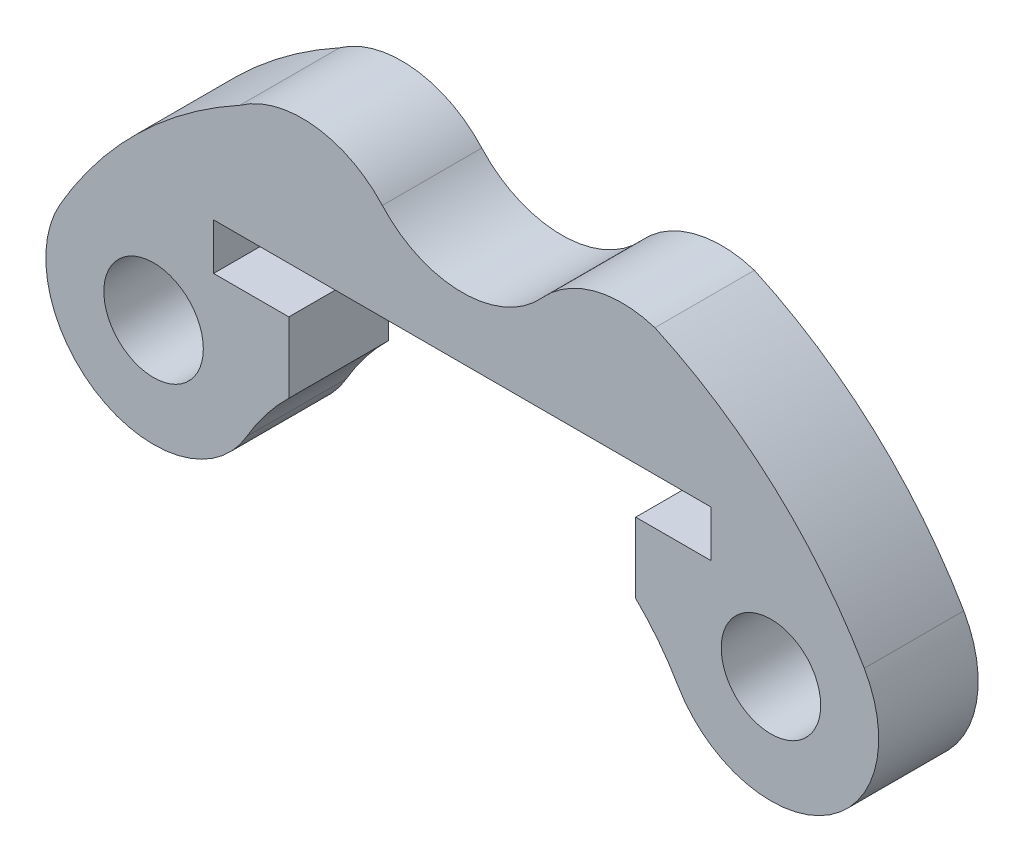
ISO-10303-21;
HEADER;
FILE_DESCRIPTION(('STEP AP214'),'2;1');
FILE_NAME('part.step','',(''),(''),'','','');
FILE_SCHEMA(('AUTOMOTIVE_DESIGN { 1 0 10303 214 1 1 1 1 }'));
ENDSEC;
DATA;
#1=APPLICATION_CONTEXT('core data for automotive mechanical design processes');
#2=APPLICATION_PROTOCOL_DEFINITION('international standard','automotive_design',2000,#1);
#3=PRODUCT_CONTEXT('',#1,'mechanical');
#4=PRODUCT('Part','Part','',(#3));
#5=PRODUCT_RELATED_PRODUCT_CATEGORY('part','',(#4));
#6=PRODUCT_DEFINITION_FORMATION('','',#4);
#7=PRODUCT_DEFINITION_CONTEXT('part definition',#1,'design');
#8=PRODUCT_DEFINITION('design','',#6,#7);
#9=PRODUCT_DEFINITION_SHAPE('','',#8);
#10=(LENGTH_UNIT() NAMED_UNIT(*) SI_UNIT(.MILLI.,.METRE.));
#11=(NAMED_UNIT(*) PLANE_ANGLE_UNIT() SI_UNIT($,.RADIAN.));
#12=(NAMED_UNIT(*) SI_UNIT($,.STERADIAN.) SOLID_ANGLE_UNIT());
#13=UNCERTAINTY_MEASURE_WITH_UNIT(LENGTH_MEASURE(1.E-05),#10,'distance_accuracy_value','');
#14=(GEOMETRIC_REPRESENTATION_CONTEXT(3) GLOBAL_UNCERTAINTY_ASSIGNED_CONTEXT((#13)) GLOBAL_UNIT_ASSIGNED_CONTEXT((#10,
#11,#12)) REPRESENTATION_CONTEXT('',''));
#15=CARTESIAN_POINT('',(0.,0.,0.));
#16=DIRECTION('',(0.,0.,1.));
#17=DIRECTION('',(1.,0.,0.));
#18=AXIS2_PLACEMENT_3D('',#15,#16,#17);
#19=CARTESIAN_POINT('',(0.,0.,3.));
#20=DIRECTION('',(0.,0.,1.));
#21=DIRECTION('',(1.,0.,0.));
#22=AXIS2_PLACEMENT_3D('',#19,#20,#21);
#23=PLANE('',#22);
#24=CARTESIAN_POINT('',(9.30977309068468,5.3749999999966,3.));
#25=DIRECTION('',(0.,0.,1.));
#26=DIRECTION('',(1.,0.,0.));
#27=AXIS2_PLACEMENT_3D('',#24,#25,#26);
#28=CIRCLE('',#27,1.49999999999907);
#29=CARTESIAN_POINT('',(10.8097730906838,5.3749999999966,3.));
#30=VERTEX_POINT('',#29);
#31=EDGE_CURVE('E181',#30,#30,#28,.T.);
#32=ORIENTED_EDGE('',*,*,#31,.F.);
#33=EDGE_LOOP('',(#32));
#34=FACE_BOUND('',#33,.T.);
#35=DIRECTION('',(0.,-1.,0.));
#36=VECTOR('',#35,1.);
#37=CARTESIAN_POINT('',(7.5000000000001,8.9,3.));
#38=LINE('',#37,#36);
#39=CARTESIAN_POINT('',(7.5000000000001,8.9,3.));
#40=VERTEX_POINT('',#39);
#41=CARTESIAN_POINT('',(7.5,7.5,3.));
#42=VERTEX_POINT('',#41);
#43=EDGE_CURVE('E208',#40,#42,#38,.T.);
#44=ORIENTED_EDGE('',*,*,#43,.T.);
#45=DIRECTION('',(-1.,0.,0.));
#46=VECTOR('',#45,1.);
#47=CARTESIAN_POINT('',(5.23061898822938,7.5,3.));
#48=LINE('',#47,#46);
#49=CARTESIAN_POINT('',(5.23061898822938,7.5,3.));
#50=VERTEX_POINT('',#49);
#51=EDGE_CURVE('E116',#42,#50,#48,.T.);
#52=ORIENTED_EDGE('',*,*,#51,.T.);
#53=DIRECTION('',(1.351043460112E-13,-1.,0.));
#54=VECTOR('',#53,1.);
#55=CARTESIAN_POINT('',(5.23061898822966,5.37499999999733,3.));
#56=LINE('',#55,#54);
#57=CARTESIAN_POINT('',(5.23061898822966,5.37499999999733,3.));
#58=VERTEX_POINT('',#57);
#59=EDGE_CURVE('E247',#50,#58,#56,.T.);
#60=ORIENTED_EDGE('',*,*,#59,.T.);
#61=CARTESIAN_POINT('',(0.,0.,3.));
#62=DIRECTION('',(0.,0.,-1.));
#63=DIRECTION('',(1.,0.,0.));
#64=AXIS2_PLACEMENT_3D('',#61,#62,#63);
#65=CIRCLE('',#64,7.5);
#66=CARTESIAN_POINT('',(6.49519052838322,3.75000000000011,3.));
#67=VERTEX_POINT('',#66);
#68=EDGE_CURVE('E266',#58,#67,#65,.T.);
#69=ORIENTED_EDGE('',*,*,#68,.T.);
#70=CARTESIAN_POINT('',(9.30977309068468,5.3749999999966,3.));
#71=DIRECTION('',(0.,0.,1.));
#72=DIRECTION('',(1.,0.,0.));
#73=AXIS2_PLACEMENT_3D('',#70,#71,#72);
#74=CIRCLE('',#73,3.25);
#75=CARTESIAN_POINT('',(12.1243556529847,6.99999999999558,3.));
#76=VERTEX_POINT('',#75);
#77=EDGE_CURVE('E263',#67,#76,#74,.T.);
#78=ORIENTED_EDGE('',*,*,#77,.T.);
#79=CARTESIAN_POINT('',(0.,0.,3.));
#80=DIRECTION('',(0.,0.,1.));
#81=DIRECTION('',(1.,0.,0.));
#82=AXIS2_PLACEMENT_3D('',#79,#80,#81);
#83=CIRCLE('',#82,14.);
#84=CARTESIAN_POINT('',(5.80943087987062,12.7377593340432,3.));
#85=VERTEX_POINT('',#84);
#86=EDGE_CURVE('E265',#76,#85,#83,.T.);
#87=ORIENTED_EDGE('',*,*,#86,.T.);
#88=CARTESIAN_POINT('',(4.82206978136234,9.64137142857136,3.));
#89=DIRECTION('',(0.,0.,1.));
#90=DIRECTION('',(1.,0.,0.));
#91=AXIS2_PLACEMENT_3D('',#88,#89,#90);
#92=CIRCLE('',#91,3.25);
#93=CARTESIAN_POINT('',(2.4110348906791,11.8206857142833,3.));
#94=VERTEX_POINT('',#93);
#95=EDGE_CURVE('E268',#85,#94,#92,.T.);
#96=ORIENTED_EDGE('',*,*,#95,.T.);
#97=CARTESIAN_POINT('',(1.07437023516552E-11,13.9999999999817,3.));
#98=DIRECTION('',(0.,0.,-1.));
#99=DIRECTION('',(1.,0.,0.));
#100=AXIS2_PLACEMENT_3D('',#97,#98,#99);
#101=CIRCLE('',#100,3.24999999997992);
#102=CARTESIAN_POINT('',(-2.41103489066095,11.820685714287,3.));
#103=VERTEX_POINT('',#102);
#104=EDGE_CURVE('E274',#94,#103,#101,.T.);
#105=ORIENTED_EDGE('',*,*,#104,.T.);
#106=CARTESIAN_POINT('',(-4.82206978134755,9.64137142857876,3.));
#107=DIRECTION('',(0.,0.,1.));
#108=DIRECTION('',(1.,0.,0.));
#109=AXIS2_PLACEMENT_3D('',#106,#107,#108);
#110=CIRCLE('',#109,3.25);
#111=CARTESIAN_POINT('',(-6.70737151186402,12.2886601141799,3.));
#112=VERTEX_POINT('',#111);
#113=EDGE_CURVE('E276',#103,#112,#110,.T.);
#114=ORIENTED_EDGE('',*,*,#113,.T.);
#115=CARTESIAN_POINT('',(0.,0.,3.));
#116=DIRECTION('',(0.,0.,1.));
#117=DIRECTION('',(1.,0.,0.));
#118=AXIS2_PLACEMENT_3D('',#115,#116,#117);
#119=CIRCLE('',#118,14.);
#120=CARTESIAN_POINT('',(-12.1243556529822,6.99999999999988,3.));
#121=VERTEX_POINT('',#120);
#122=EDGE_CURVE('E278',#112,#121,#119,.T.);
#123=ORIENTED_EDGE('',*,*,#122,.T.);
#124=CARTESIAN_POINT('',(-9.30977309068277,5.37499999999991,3.));
#125=DIRECTION('',(0.,0.,1.));
#126=DIRECTION('',(1.,0.,0.));
#127=AXIS2_PLACEMENT_3D('',#124,#125,#126);
#128=CIRCLE('',#127,3.25);
#129=CARTESIAN_POINT('',(-6.49519052838333,3.74999999999993,3.));
#130=VERTEX_POINT('',#129);
#131=EDGE_CURVE('E280',#121,#130,#128,.T.);
#132=ORIENTED_EDGE('',*,*,#131,.T.);
#133=CARTESIAN_POINT('',(0.,0.,3.));
#134=DIRECTION('',(0.,0.,-1.));
#135=DIRECTION('',(1.,0.,0.));
#136=AXIS2_PLACEMENT_3D('',#133,#134,#135);
#137=CIRCLE('',#136,7.5);
#138=CARTESIAN_POINT('',(-5.23061898822776,5.37499999999918,3.));
#139=VERTEX_POINT('',#138);
#140=EDGE_CURVE('E282',#130,#139,#137,.T.);
#141=ORIENTED_EDGE('',*,*,#140,.T.);
#142=DIRECTION('',(0.,1.,0.));
#143=VECTOR('',#142,1.);
#144=CARTESIAN_POINT('',(-5.23061898822776,5.37499999999918,3.));
#145=LINE('',#144,#143);
#146=CARTESIAN_POINT('',(-5.2306189882276,7.5,3.));
#147=VERTEX_POINT('',#146);
#148=EDGE_CURVE('E159',#139,#147,#145,.T.);
#149=ORIENTED_EDGE('',*,*,#148,.T.);
#150=DIRECTION('',(-1.,0.,0.));
#151=VECTOR('',#150,1.);
#152=CARTESIAN_POINT('',(-5.2306189882276,7.5,3.));
#153=LINE('',#152,#151);
#154=CARTESIAN_POINT('',(-7.5,7.5,3.));
#155=VERTEX_POINT('',#154);
#156=EDGE_CURVE('E153',#147,#155,#153,.T.);
#157=ORIENTED_EDGE('',*,*,#156,.T.);
#158=DIRECTION('',(0.,1.,0.));
#159=VECTOR('',#158,1.);
#160=CARTESIAN_POINT('',(-7.5,7.5,3.));
#161=LINE('',#160,#159);
#162=CARTESIAN_POINT('',(-7.4999999999999,8.9,3.));
#163=VERTEX_POINT('',#162);
#164=EDGE_CURVE('E157',#155,#163,#161,.T.);
#165=ORIENTED_EDGE('',*,*,#164,.T.);
#166=DIRECTION('',(1.,0.,0.));
#167=VECTOR('',#166,1.);
#168=CARTESIAN_POINT('',(7.5000000000001,8.9,3.));
#169=LINE('',#168,#167);
#170=EDGE_CURVE('E49',#163,#40,#169,.T.);
#171=ORIENTED_EDGE('',*,*,#170,.T.);
#172=EDGE_LOOP('',(#44,#52,#60,#69,#78,#87,#96,#105,#114,#123,#132,#141,#149,#157,#165,#171));
#173=FACE_BOUND('',#172,.T.);
#174=CARTESIAN_POINT('',(-9.30977309068277,5.37499999999991,3.));
#175=DIRECTION('',(0.,0.,1.));
#176=DIRECTION('',(1.,0.,0.));
#177=AXIS2_PLACEMENT_3D('',#174,#175,#176);
#178=CIRCLE('',#177,1.5);
#179=CARTESIAN_POINT('',(-7.80977309068277,5.37499999999991,3.));
#180=VERTEX_POINT('',#179);
#181=EDGE_CURVE('E324',#180,#180,#178,.T.);
#182=ORIENTED_EDGE('',*,*,#181,.F.);
#183=EDGE_LOOP('',(#182));
#184=FACE_BOUND('',#183,.T.);
#185=ADVANCED_FACE('F32',(#34,#173,#184),#23,.T.);
#186=CARTESIAN_POINT('',(0.,0.,0.));
#187=DIRECTION('',(0.,0.,1.));
#188=DIRECTION('',(1.,0.,0.));
#189=AXIS2_PLACEMENT_3D('',#186,#187,#188);
#190=PLANE('',#189);
#191=DIRECTION('',(0.,-1.,0.));
#192=VECTOR('',#191,1.);
#193=CARTESIAN_POINT('',(7.5000000000001,8.9,0.));
#194=LINE('',#193,#192);
#195=CARTESIAN_POINT('',(7.5000000000001,8.9,0.));
#196=VERTEX_POINT('',#195);
#197=CARTESIAN_POINT('',(7.5,7.5,0.));
#198=VERTEX_POINT('',#197);
#199=EDGE_CURVE('E177',#196,#198,#194,.T.);
#200=ORIENTED_EDGE('',*,*,#199,.F.);
#201=DIRECTION('',(1.,0.,0.));
#202=VECTOR('',#201,1.);
#203=CARTESIAN_POINT('',(7.5000000000001,8.9,0.));
#204=LINE('',#203,#202);
#205=CARTESIAN_POINT('',(-7.4999999999999,8.9,0.));
#206=VERTEX_POINT('',#205);
#207=EDGE_CURVE('E108',#206,#196,#204,.T.);
#208=ORIENTED_EDGE('',*,*,#207,.F.);
#209=DIRECTION('',(0.,1.,0.));
#210=VECTOR('',#209,1.);
#211=CARTESIAN_POINT('',(-7.5,7.5,0.));
#212=LINE('',#211,#210);
#213=CARTESIAN_POINT('',(-7.5,7.5,0.));
#214=VERTEX_POINT('',#213);
#215=EDGE_CURVE('E102',#214,#206,#212,.T.);
#216=ORIENTED_EDGE('',*,*,#215,.F.);
#217=DIRECTION('',(-1.,0.,0.));
#218=VECTOR('',#217,1.);
#219=CARTESIAN_POINT('',(-5.2306189882276,7.5,0.));
#220=LINE('',#219,#218);
#221=CARTESIAN_POINT('',(-5.2306189882276,7.5,0.));
#222=VERTEX_POINT('',#221);
#223=EDGE_CURVE('E167',#222,#214,#220,.T.);
#224=ORIENTED_EDGE('',*,*,#223,.F.);
#225=DIRECTION('',(0.,1.,0.));
#226=VECTOR('',#225,1.);
#227=CARTESIAN_POINT('',(-5.23061898822776,5.37499999999918,0.));
#228=LINE('',#227,#226);
#229=CARTESIAN_POINT('',(-5.23061898822776,5.37499999999918,0.));
#230=VERTEX_POINT('',#229);
#231=EDGE_CURVE('E203',#230,#222,#228,.T.);
#232=ORIENTED_EDGE('',*,*,#231,.F.);
#233=CARTESIAN_POINT('',(0.,0.,0.));
#234=DIRECTION('',(0.,0.,-1.));
#235=DIRECTION('',(1.,0.,0.));
#236=AXIS2_PLACEMENT_3D('',#233,#234,#235);
#237=CIRCLE('',#236,7.5);
#238=CARTESIAN_POINT('',(-6.49519052838333,3.74999999999993,0.));
#239=VERTEX_POINT('',#238);
#240=EDGE_CURVE('E201',#239,#230,#237,.T.);
#241=ORIENTED_EDGE('',*,*,#240,.F.);
#242=CARTESIAN_POINT('',(-9.30977309068277,5.37499999999991,0.));
#243=DIRECTION('',(0.,0.,1.));
#244=DIRECTION('',(1.,0.,0.));
#245=AXIS2_PLACEMENT_3D('',#242,#243,#244);
#246=CIRCLE('',#245,3.25);
#247=CARTESIAN_POINT('',(-12.1243556529822,6.99999999999988,0.));
#248=VERTEX_POINT('',#247);
#249=EDGE_CURVE('E199',#248,#239,#246,.T.);
#250=ORIENTED_EDGE('',*,*,#249,.F.);
#251=CARTESIAN_POINT('',(0.,0.,0.));
#252=DIRECTION('',(0.,0.,1.));
#253=DIRECTION('',(1.,0.,0.));
#254=AXIS2_PLACEMENT_3D('',#251,#252,#253);
#255=CIRCLE('',#254,14.);
#256=CARTESIAN_POINT('',(-6.70737151186402,12.2886601141799,0.));
#257=VERTEX_POINT('',#256);
#258=EDGE_CURVE('E197',#257,#248,#255,.T.);
#259=ORIENTED_EDGE('',*,*,#258,.F.);
#260=CARTESIAN_POINT('',(-4.82206978134755,9.64137142857876,0.));
#261=DIRECTION('',(0.,0.,1.));
#262=DIRECTION('',(1.,0.,0.));
#263=AXIS2_PLACEMENT_3D('',#260,#261,#262);
#264=CIRCLE('',#263,3.25);
#265=CARTESIAN_POINT('',(-2.41103489066095,11.820685714287,0.));
#266=VERTEX_POINT('',#265);
#267=EDGE_CURVE('E195',#266,#257,#264,.T.);
#268=ORIENTED_EDGE('',*,*,#267,.F.);
#269=CARTESIAN_POINT('',(1.07437023516552E-11,13.9999999999817,0.));
#270=DIRECTION('',(0.,0.,-1.));
#271=DIRECTION('',(1.,0.,0.));
#272=AXIS2_PLACEMENT_3D('',#269,#270,#271);
#273=CIRCLE('',#272,3.24999999997992);
#274=CARTESIAN_POINT('',(2.4110348906791,11.8206857142833,0.));
#275=VERTEX_POINT('',#274);
#276=EDGE_CURVE('E193',#275,#266,#273,.T.);
#277=ORIENTED_EDGE('',*,*,#276,.F.);
#278=CARTESIAN_POINT('',(4.82206978136234,9.64137142857136,0.));
#279=DIRECTION('',(0.,0.,1.));
#280=DIRECTION('',(1.,0.,0.));
#281=AXIS2_PLACEMENT_3D('',#278,#279,#280);
#282=CIRCLE('',#281,3.25);
#283=CARTESIAN_POINT('',(5.80943087987062,12.7377593340432,0.));
#284=VERTEX_POINT('',#283);
#285=EDGE_CURVE('E191',#284,#275,#282,.T.);
#286=ORIENTED_EDGE('',*,*,#285,.F.);
#287=CARTESIAN_POINT('',(0.,0.,0.));
#288=DIRECTION('',(0.,0.,1.));
#289=DIRECTION('',(1.,0.,0.));
#290=AXIS2_PLACEMENT_3D('',#287,#288,#289);
#291=CIRCLE('',#290,14.);
#292=CARTESIAN_POINT('',(12.1243556529847,6.99999999999558,0.));
#293=VERTEX_POINT('',#292);
#294=EDGE_CURVE('E189',#293,#284,#291,.T.);
#295=ORIENTED_EDGE('',*,*,#294,.F.);
#296=CARTESIAN_POINT('',(9.30977309068468,5.3749999999966,0.));
#297=DIRECTION('',(0.,0.,1.));
#298=DIRECTION('',(1.,0.,0.));
#299=AXIS2_PLACEMENT_3D('',#296,#297,#298);
#300=CIRCLE('',#299,3.25);
#301=CARTESIAN_POINT('',(6.49519052838322,3.75000000000011,0.));
#302=VERTEX_POINT('',#301);
#303=EDGE_CURVE('E187',#302,#293,#300,.T.);
#304=ORIENTED_EDGE('',*,*,#303,.F.);
#305=CARTESIAN_POINT('',(0.,0.,0.));
#306=DIRECTION('',(0.,0.,-1.));
#307=DIRECTION('',(1.,0.,0.));
#308=AXIS2_PLACEMENT_3D('',#305,#306,#307);
#309=CIRCLE('',#308,7.5);
#310=CARTESIAN_POINT('',(5.23061898822966,5.37499999999733,0.));
#311=VERTEX_POINT('',#310);
#312=EDGE_CURVE('E185',#311,#302,#309,.T.);
#313=ORIENTED_EDGE('',*,*,#312,.F.);
#314=DIRECTION('',(1.351043460112E-13,-1.,0.));
#315=VECTOR('',#314,1.);
#316=CARTESIAN_POINT('',(5.23061898822966,5.37499999999733,0.));
#317=LINE('',#316,#315);
#318=CARTESIAN_POINT('',(5.23061898822938,7.5,0.));
#319=VERTEX_POINT('',#318);
#320=EDGE_CURVE('E183',#319,#311,#317,.T.);
#321=ORIENTED_EDGE('',*,*,#320,.F.);
#322=DIRECTION('',(-1.,0.,0.));
#323=VECTOR('',#322,1.);
#324=CARTESIAN_POINT('',(5.23061898822938,7.5,0.));
#325=LINE('',#324,#323);
#326=EDGE_CURVE('E180',#198,#319,#325,.T.);
#327=ORIENTED_EDGE('',*,*,#326,.F.);
#328=EDGE_LOOP('',(#200,#208,#216,#224,#232,#241,#250,#259,#268,#277,#286,#295,#304,#313,#321,#327));
#329=FACE_BOUND('',#328,.T.);
#330=CARTESIAN_POINT('',(9.30977309068468,5.3749999999966,0.));
#331=DIRECTION('',(0.,0.,1.));
#332=DIRECTION('',(1.,0.,0.));
#333=AXIS2_PLACEMENT_3D('',#330,#331,#332);
#334=CIRCLE('',#333,1.49999999999907);
#335=CARTESIAN_POINT('',(10.8097730906838,5.3749999999966,0.));
#336=VERTEX_POINT('',#335);
#337=EDGE_CURVE('E330',#336,#336,#334,.T.);
#338=ORIENTED_EDGE('',*,*,#337,.T.);
#339=EDGE_LOOP('',(#338));
#340=FACE_BOUND('',#339,.T.);
#341=CARTESIAN_POINT('',(-9.30977309068277,5.37499999999991,0.));
#342=DIRECTION('',(0.,0.,1.));
#343=DIRECTION('',(1.,0.,0.));
#344=AXIS2_PLACEMENT_3D('',#341,#342,#343);
#345=CIRCLE('',#344,1.5);
#346=CARTESIAN_POINT('',(-7.80977309068277,5.37499999999991,0.));
#347=VERTEX_POINT('',#346);
#348=EDGE_CURVE('E327',#347,#347,#345,.T.);
#349=ORIENTED_EDGE('',*,*,#348,.T.);
#350=EDGE_LOOP('',(#349));
#351=FACE_BOUND('',#350,.T.);
#352=ADVANCED_FACE('F251',(#329,#340,#351),#190,.F.);
#353=CARTESIAN_POINT('',(7.5000000000001,8.9,3.));
#354=DIRECTION('',(1.,0.,0.));
#355=DIRECTION('',(0.,1.,0.));
#356=AXIS2_PLACEMENT_3D('',#353,#354,#355);
#357=PLANE('',#356);
#358=ORIENTED_EDGE('',*,*,#199,.T.);
#359=DIRECTION('',(0.,0.,-1.));
#360=VECTOR('',#359,1.);
#361=CARTESIAN_POINT('',(7.5,7.5,3.));
#362=LINE('',#361,#360);
#363=EDGE_CURVE('E11',#42,#198,#362,.T.);
#364=ORIENTED_EDGE('',*,*,#363,.F.);
#365=ORIENTED_EDGE('',*,*,#43,.F.);
#366=DIRECTION('',(0.,0.,-1.));
#367=VECTOR('',#366,1.);
#368=CARTESIAN_POINT('',(7.5000000000001,8.9,3.));
#369=LINE('',#368,#367);
#370=EDGE_CURVE('E173',#40,#196,#369,.T.);
#371=ORIENTED_EDGE('',*,*,#370,.T.);
#372=EDGE_LOOP('',(#358,#364,#365,#371));
#373=FACE_BOUND('',#372,.T.);
#374=ADVANCED_FACE('F34',(#373),#357,.F.);
#375=CARTESIAN_POINT('',(5.23061898822938,7.5,3.));
#376=DIRECTION('',(0.,-1.,0.));
#377=DIRECTION('',(1.,0.,0.));
#378=AXIS2_PLACEMENT_3D('',#375,#376,#377);
#379=PLANE('',#378);
#380=ORIENTED_EDGE('',*,*,#326,.T.);
#381=DIRECTION('',(0.,0.,-1.));
#382=VECTOR('',#381,1.);
#383=CARTESIAN_POINT('',(5.23061898822938,7.5,3.));
#384=LINE('',#383,#382);
#385=EDGE_CURVE('E41',#50,#319,#384,.T.);
#386=ORIENTED_EDGE('',*,*,#385,.F.);
#387=ORIENTED_EDGE('',*,*,#51,.F.);
#388=ORIENTED_EDGE('',*,*,#363,.T.);
#389=EDGE_LOOP('',(#380,#386,#387,#388));
#390=FACE_BOUND('',#389,.T.);
#391=ADVANCED_FACE('F463',(#390),#379,.F.);
#392=CARTESIAN_POINT('',(5.23061898822966,5.37499999999733,3.));
#393=DIRECTION('',(1.,1.351043460112E-13,0.));
#394=DIRECTION('',(-1.351043460112E-13,1.,0.));
#395=AXIS2_PLACEMENT_3D('',#392,#393,#394);
#396=PLANE('',#395);
#397=ORIENTED_EDGE('',*,*,#320,.T.);
#398=DIRECTION('',(0.,0.,-1.));
#399=VECTOR('',#398,1.);
#400=CARTESIAN_POINT('',(5.23061898822966,5.37499999999733,3.));
#401=LINE('',#400,#399);
#402=EDGE_CURVE('E239',#58,#311,#401,.T.);
#403=ORIENTED_EDGE('',*,*,#402,.F.);
#404=ORIENTED_EDGE('',*,*,#59,.F.);
#405=ORIENTED_EDGE('',*,*,#385,.T.);
#406=EDGE_LOOP('',(#397,#403,#404,#405));
#407=FACE_BOUND('',#406,.T.);
#408=ADVANCED_FACE('F245',(#407),#396,.F.);
#409=CARTESIAN_POINT('',(0.,0.,3.));
#410=DIRECTION('',(0.,0.,-1.));
#411=DIRECTION('',(-1.,0.,0.));
#412=AXIS2_PLACEMENT_3D('',#409,#410,#411);
#413=CYLINDRICAL_SURFACE('',#412,7.5);
#414=ORIENTED_EDGE('',*,*,#312,.T.);
#415=DIRECTION('',(0.,0.,-1.));
#416=VECTOR('',#415,1.);
#417=CARTESIAN_POINT('',(6.49519052838322,3.75000000000011,3.));
#418=LINE('',#417,#416);
#419=EDGE_CURVE('E236',#67,#302,#418,.T.);
#420=ORIENTED_EDGE('',*,*,#419,.F.);
#421=ORIENTED_EDGE('',*,*,#68,.F.);
#422=ORIENTED_EDGE('',*,*,#402,.T.);
#423=EDGE_LOOP('',(#414,#420,#421,#422));
#424=FACE_BOUND('',#423,.T.);
#425=ADVANCED_FACE('F257',(#424),#413,.F.);
#426=CARTESIAN_POINT('',(9.30977309068468,5.3749999999966,3.));
#427=DIRECTION('',(0.,0.,-1.));
#428=DIRECTION('',(-1.,0.,0.));
#429=AXIS2_PLACEMENT_3D('',#426,#427,#428);
#430=CYLINDRICAL_SURFACE('',#429,3.25);
#431=ORIENTED_EDGE('',*,*,#303,.T.);
#432=DIRECTION('',(0.,0.,-1.));
#433=VECTOR('',#432,1.);
#434=CARTESIAN_POINT('',(12.1243556529847,6.99999999999558,3.));
#435=LINE('',#434,#433);
#436=EDGE_CURVE('E233',#76,#293,#435,.T.);
#437=ORIENTED_EDGE('',*,*,#436,.F.);
#438=ORIENTED_EDGE('',*,*,#77,.F.);
#439=ORIENTED_EDGE('',*,*,#419,.T.);
#440=EDGE_LOOP('',(#431,#437,#438,#439));
#441=FACE_BOUND('',#440,.T.);
#442=ADVANCED_FACE('F261',(#441),#430,.T.);
#443=CARTESIAN_POINT('',(0.,0.,3.));
#444=DIRECTION('',(0.,0.,-1.));
#445=DIRECTION('',(-1.,0.,0.));
#446=AXIS2_PLACEMENT_3D('',#443,#444,#445);
#447=CYLINDRICAL_SURFACE('',#446,14.);
#448=ORIENTED_EDGE('',*,*,#294,.T.);
#449=DIRECTION('',(0.,0.,-1.));
#450=VECTOR('',#449,1.);
#451=CARTESIAN_POINT('',(5.80943087987062,12.7377593340432,3.));
#452=LINE('',#451,#450);
#453=EDGE_CURVE('E230',#85,#284,#452,.T.);
#454=ORIENTED_EDGE('',*,*,#453,.F.);
#455=ORIENTED_EDGE('',*,*,#86,.F.);
#456=ORIENTED_EDGE('',*,*,#436,.T.);
#457=EDGE_LOOP('',(#448,#454,#455,#456));
#458=FACE_BOUND('',#457,.T.);
#459=ADVANCED_FACE('F428',(#458),#447,.T.);
#460=CARTESIAN_POINT('',(4.82206978136234,9.64137142857136,3.));
#461=DIRECTION('',(0.,0.,-1.));
#462=DIRECTION('',(-1.,0.,0.));
#463=AXIS2_PLACEMENT_3D('',#460,#461,#462);
#464=CYLINDRICAL_SURFACE('',#463,3.25);
#465=ORIENTED_EDGE('',*,*,#285,.T.);
#466=DIRECTION('',(0.,0.,-1.));
#467=VECTOR('',#466,1.);
#468=CARTESIAN_POINT('',(2.4110348906791,11.8206857142833,3.));
#469=LINE('',#468,#467);
#470=EDGE_CURVE('E227',#94,#275,#469,.T.);
#471=ORIENTED_EDGE('',*,*,#470,.F.);
#472=ORIENTED_EDGE('',*,*,#95,.F.);
#473=ORIENTED_EDGE('',*,*,#453,.T.);
#474=EDGE_LOOP('',(#465,#471,#472,#473));
#475=FACE_BOUND('',#474,.T.);
#476=ADVANCED_FACE('F418',(#475),#464,.T.);
#477=CARTESIAN_POINT('',(1.07437023516552E-11,13.9999999999817,3.));
#478=DIRECTION('',(0.,0.,-1.));
#479=DIRECTION('',(-1.,0.,0.));
#480=AXIS2_PLACEMENT_3D('',#477,#478,#479);
#481=CYLINDRICAL_SURFACE('',#480,3.24999999997992);
#482=ORIENTED_EDGE('',*,*,#276,.T.);
#483=DIRECTION('',(0.,0.,-1.));
#484=VECTOR('',#483,1.);
#485=CARTESIAN_POINT('',(-2.41103489066095,11.820685714287,3.));
#486=LINE('',#485,#484);
#487=EDGE_CURVE('E224',#103,#266,#486,.T.);
#488=ORIENTED_EDGE('',*,*,#487,.F.);
#489=ORIENTED_EDGE('',*,*,#104,.F.);
#490=ORIENTED_EDGE('',*,*,#470,.T.);
#491=EDGE_LOOP('',(#482,#488,#489,#490));
#492=FACE_BOUND('',#491,.T.);
#493=ADVANCED_FACE('F408',(#492),#481,.F.);
#494=CARTESIAN_POINT('',(-4.82206978134755,9.64137142857876,3.));
#495=DIRECTION('',(0.,0.,-1.));
#496=DIRECTION('',(-1.,0.,0.));
#497=AXIS2_PLACEMENT_3D('',#494,#495,#496);
#498=CYLINDRICAL_SURFACE('',#497,3.25);
#499=ORIENTED_EDGE('',*,*,#267,.T.);
#500=DIRECTION('',(0.,0.,-1.));
#501=VECTOR('',#500,1.);
#502=CARTESIAN_POINT('',(-6.70737151186402,12.2886601141799,3.));
#503=LINE('',#502,#501);
#504=EDGE_CURVE('E221',#112,#257,#503,.T.);
#505=ORIENTED_EDGE('',*,*,#504,.F.);
#506=ORIENTED_EDGE('',*,*,#113,.F.);
#507=ORIENTED_EDGE('',*,*,#487,.T.);
#508=EDGE_LOOP('',(#499,#505,#506,#507));
#509=FACE_BOUND('',#508,.T.);
#510=ADVANCED_FACE('F398',(#509),#498,.T.);
#511=CARTESIAN_POINT('',(0.,0.,3.));
#512=DIRECTION('',(0.,0.,-1.));
#513=DIRECTION('',(-1.,0.,0.));
#514=AXIS2_PLACEMENT_3D('',#511,#512,#513);
#515=CYLINDRICAL_SURFACE('',#514,14.);
#516=ORIENTED_EDGE('',*,*,#258,.T.);
#517=DIRECTION('',(0.,0.,-1.));
#518=VECTOR('',#517,1.);
#519=CARTESIAN_POINT('',(-12.1243556529822,6.99999999999988,3.));
#520=LINE('',#519,#518);
#521=EDGE_CURVE('E218',#121,#248,#520,.T.);
#522=ORIENTED_EDGE('',*,*,#521,.F.);
#523=ORIENTED_EDGE('',*,*,#122,.F.);
#524=ORIENTED_EDGE('',*,*,#504,.T.);
#525=EDGE_LOOP('',(#516,#522,#523,#524));
#526=FACE_BOUND('',#525,.T.);
#527=ADVANCED_FACE('F388',(#526),#515,.T.);
#528=CARTESIAN_POINT('',(-9.30977309068277,5.37499999999991,3.));
#529=DIRECTION('',(0.,0.,-1.));
#530=DIRECTION('',(-1.,0.,0.));
#531=AXIS2_PLACEMENT_3D('',#528,#529,#530);
#532=CYLINDRICAL_SURFACE('',#531,3.25);
#533=ORIENTED_EDGE('',*,*,#249,.T.);
#534=DIRECTION('',(0.,0.,-1.));
#535=VECTOR('',#534,1.);
#536=CARTESIAN_POINT('',(-6.49519052838333,3.74999999999993,3.));
#537=LINE('',#536,#535);
#538=EDGE_CURVE('E215',#130,#239,#537,.T.);
#539=ORIENTED_EDGE('',*,*,#538,.F.);
#540=ORIENTED_EDGE('',*,*,#131,.F.);
#541=ORIENTED_EDGE('',*,*,#521,.T.);
#542=EDGE_LOOP('',(#533,#539,#540,#541));
#543=FACE_BOUND('',#542,.T.);
#544=ADVANCED_FACE('F379',(#543),#532,.T.);
#545=CARTESIAN_POINT('',(0.,0.,3.));
#546=DIRECTION('',(0.,0.,-1.));
#547=DIRECTION('',(-1.,0.,0.));
#548=AXIS2_PLACEMENT_3D('',#545,#546,#547);
#549=CYLINDRICAL_SURFACE('',#548,7.5);
#550=ORIENTED_EDGE('',*,*,#240,.T.);
#551=DIRECTION('',(0.,0.,-1.));
#552=VECTOR('',#551,1.);
#553=CARTESIAN_POINT('',(-5.23061898822776,5.37499999999918,3.));
#554=LINE('',#553,#552);
#555=EDGE_CURVE('E212',#139,#230,#554,.T.);
#556=ORIENTED_EDGE('',*,*,#555,.F.);
#557=ORIENTED_EDGE('',*,*,#140,.F.);
#558=ORIENTED_EDGE('',*,*,#538,.T.);
#559=EDGE_LOOP('',(#550,#556,#557,#558));
#560=FACE_BOUND('',#559,.T.);
#561=ADVANCED_FACE('F288',(#560),#549,.F.);
#562=CARTESIAN_POINT('',(-5.23061898822776,5.37499999999918,3.));
#563=DIRECTION('',(-1.,0.,0.));
#564=DIRECTION('',(0.,-1.,0.));
#565=AXIS2_PLACEMENT_3D('',#562,#563,#564);
#566=PLANE('',#565);
#567=ORIENTED_EDGE('',*,*,#231,.T.);
#568=DIRECTION('',(0.,0.,-1.));
#569=VECTOR('',#568,1.);
#570=CARTESIAN_POINT('',(-5.2306189882276,7.5,3.));
#571=LINE('',#570,#569);
#572=EDGE_CURVE('E168',#147,#222,#571,.T.);
#573=ORIENTED_EDGE('',*,*,#572,.F.);
#574=ORIENTED_EDGE('',*,*,#148,.F.);
#575=ORIENTED_EDGE('',*,*,#555,.T.);
#576=EDGE_LOOP('',(#567,#573,#574,#575));
#577=FACE_BOUND('',#576,.T.);
#578=ADVANCED_FACE('F292',(#577),#566,.F.);
#579=CARTESIAN_POINT('',(-5.2306189882276,7.5,3.));
#580=DIRECTION('',(0.,-1.,0.));
#581=DIRECTION('',(0.,0.,-1.));
#582=AXIS2_PLACEMENT_3D('',#579,#580,#581);
#583=PLANE('',#582);
#584=ORIENTED_EDGE('',*,*,#223,.T.);
#585=DIRECTION('',(0.,0.,-1.));
#586=VECTOR('',#585,1.);
#587=CARTESIAN_POINT('',(-7.5,7.5,3.));
#588=LINE('',#587,#586);
#589=EDGE_CURVE('E164',#155,#214,#588,.T.);
#590=ORIENTED_EDGE('',*,*,#589,.F.);
#591=ORIENTED_EDGE('',*,*,#156,.F.);
#592=ORIENTED_EDGE('',*,*,#572,.T.);
#593=EDGE_LOOP('',(#584,#590,#591,#592));
#594=FACE_BOUND('',#593,.T.);
#595=ADVANCED_FACE('F165',(#594),#583,.F.);
#596=CARTESIAN_POINT('',(-7.5,7.5,3.));
#597=DIRECTION('',(-1.,0.,0.));
#598=DIRECTION('',(0.,-1.,0.));
#599=AXIS2_PLACEMENT_3D('',#596,#597,#598);
#600=PLANE('',#599);
#601=ORIENTED_EDGE('',*,*,#215,.T.);
#602=DIRECTION('',(0.,0.,-1.));
#603=VECTOR('',#602,1.);
#604=CARTESIAN_POINT('',(-7.4999999999999,8.9,3.));
#605=LINE('',#604,#603);
#606=EDGE_CURVE('E169',#163,#206,#605,.T.);
#607=ORIENTED_EDGE('',*,*,#606,.F.);
#608=ORIENTED_EDGE('',*,*,#164,.F.);
#609=ORIENTED_EDGE('',*,*,#589,.T.);
#610=EDGE_LOOP('',(#601,#607,#608,#609));
#611=FACE_BOUND('',#610,.T.);
#612=ADVANCED_FACE('F171',(#611),#600,.F.);
#613=CARTESIAN_POINT('',(7.5000000000001,8.9,3.));
#614=DIRECTION('',(0.,1.,0.));
#615=DIRECTION('',(-1.,0.,0.));
#616=AXIS2_PLACEMENT_3D('',#613,#614,#615);
#617=PLANE('',#616);
#618=ORIENTED_EDGE('',*,*,#207,.T.);
#619=ORIENTED_EDGE('',*,*,#370,.F.);
#620=ORIENTED_EDGE('',*,*,#170,.F.);
#621=ORIENTED_EDGE('',*,*,#606,.T.);
#622=EDGE_LOOP('',(#618,#619,#620,#621));
#623=FACE_BOUND('',#622,.T.);
#624=ADVANCED_FACE('F296',(#623),#617,.F.);
#625=CARTESIAN_POINT('',(9.30977309068468,5.3749999999966,3.));
#626=DIRECTION('',(0.,0.,-1.));
#627=DIRECTION('',(-1.,0.,0.));
#628=AXIS2_PLACEMENT_3D('',#625,#626,#627);
#629=CYLINDRICAL_SURFACE('',#628,1.49999999999907);
#630=ORIENTED_EDGE('',*,*,#31,.T.);
#631=EDGE_LOOP('',(#630));
#632=FACE_BOUND('',#631,.T.);
#633=ORIENTED_EDGE('',*,*,#337,.F.);
#634=EDGE_LOOP('',(#633));
#635=FACE_BOUND('',#634,.T.);
#636=ADVANCED_FACE('F298',(#632,#635),#629,.F.);
#637=CARTESIAN_POINT('',(-9.30977309068277,5.37499999999991,3.));
#638=DIRECTION('',(0.,0.,-1.));
#639=DIRECTION('',(-1.,0.,0.));
#640=AXIS2_PLACEMENT_3D('',#637,#638,#639);
#641=CYLINDRICAL_SURFACE('',#640,1.5);
#642=ORIENTED_EDGE('',*,*,#181,.T.);
#643=EDGE_LOOP('',(#642));
#644=FACE_BOUND('',#643,.T.);
#645=ORIENTED_EDGE('',*,*,#348,.F.);
#646=EDGE_LOOP('',(#645));
#647=FACE_BOUND('',#646,.T.);
#648=ADVANCED_FACE('F304',(#644,#647),#641,.F.);
#649=CLOSED_SHELL('',(#185,#352,#374,#391,#408,#425,#442,#459,#476,#493,#510,#527,#544,#561,
#578,#595,#612,#624,#636,#648));
#650=MANIFOLD_SOLID_BREP('B2',#649);
#651=ADVANCED_BREP_SHAPE_REPRESENTATION('',(#18,#650),#14);
#652=SHAPE_DEFINITION_REPRESENTATION(#9,#651);
ENDSEC;
END-ISO-10303-21;
